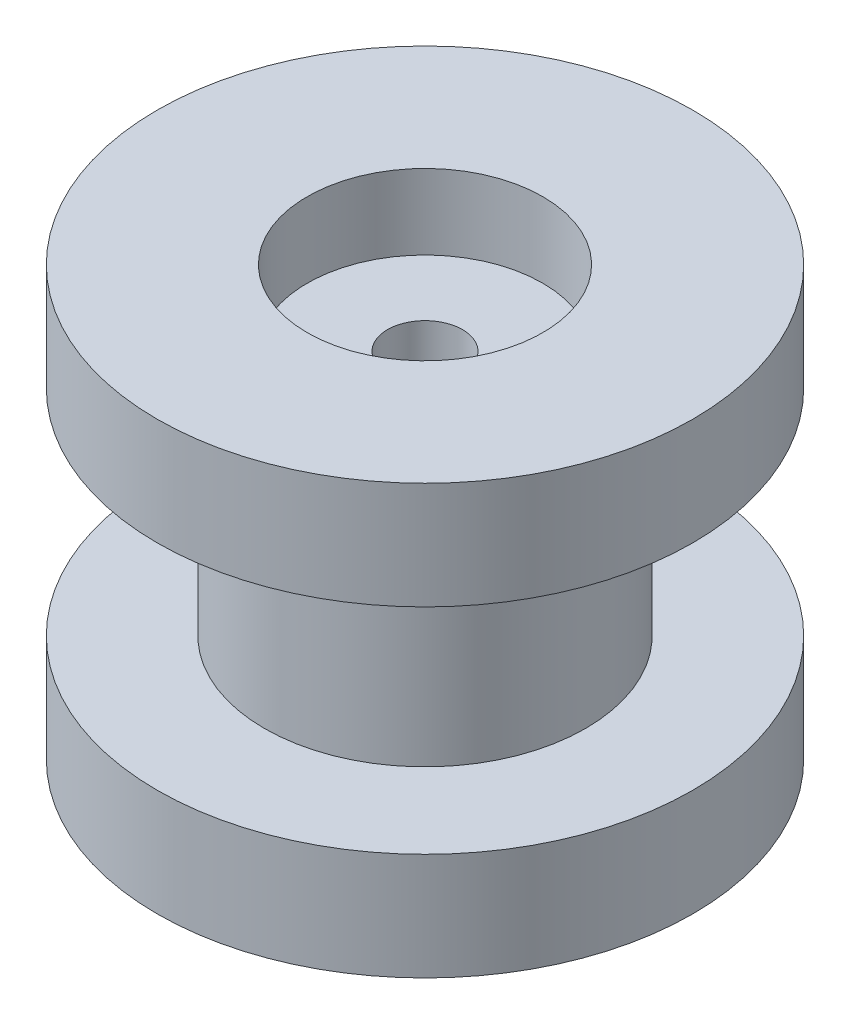
ISO-10303-21;
HEADER;
FILE_DESCRIPTION(('STEP AP214'),'2;1');
FILE_NAME('part.step','',(''),(''),'','','');
FILE_SCHEMA(('AUTOMOTIVE_DESIGN { 1 0 10303 214 1 1 1 1 }'));
ENDSEC;
DATA;
#1=APPLICATION_CONTEXT('core data for automotive mechanical design processes');
#2=APPLICATION_PROTOCOL_DEFINITION('international standard','automotive_design',2000,#1);
#3=PRODUCT_CONTEXT('',#1,'mechanical');
#4=PRODUCT('Part','Part','',(#3));
#5=PRODUCT_RELATED_PRODUCT_CATEGORY('part','',(#4));
#6=PRODUCT_DEFINITION_FORMATION('','',#4);
#7=PRODUCT_DEFINITION_CONTEXT('part definition',#1,'design');
#8=PRODUCT_DEFINITION('design','',#6,#7);
#9=PRODUCT_DEFINITION_SHAPE('','',#8);
#10=(LENGTH_UNIT() NAMED_UNIT(*) SI_UNIT(.MILLI.,.METRE.));
#11=(NAMED_UNIT(*) PLANE_ANGLE_UNIT() SI_UNIT($,.RADIAN.));
#12=(NAMED_UNIT(*) SI_UNIT($,.STERADIAN.) SOLID_ANGLE_UNIT());
#13=UNCERTAINTY_MEASURE_WITH_UNIT(LENGTH_MEASURE(1.E-05),#10,'distance_accuracy_value','');
#14=(GEOMETRIC_REPRESENTATION_CONTEXT(3) GLOBAL_UNCERTAINTY_ASSIGNED_CONTEXT((#13)) GLOBAL_UNIT_ASSIGNED_CONTEXT((#10,
#11,#12)) REPRESENTATION_CONTEXT('',''));
#15=CARTESIAN_POINT('',(0.,0.,0.));
#16=DIRECTION('',(0.,0.,1.));
#17=DIRECTION('',(1.,0.,0.));
#18=AXIS2_PLACEMENT_3D('',#15,#16,#17);
#19=CARTESIAN_POINT('',(0.,5.,0.));
#20=DIRECTION('',(0.,-1.,0.));
#21=DIRECTION('',(0.,0.,-1.));
#22=AXIS2_PLACEMENT_3D('',#19,#20,#21);
#23=CYLINDRICAL_SURFACE('',#22,12.5);
#24=CARTESIAN_POINT('',(0.,5.,0.));
#25=DIRECTION('',(0.,1.,0.));
#26=DIRECTION('',(0.,0.,1.));
#27=AXIS2_PLACEMENT_3D('',#24,#25,#26);
#28=CIRCLE('',#27,12.5);
#29=CARTESIAN_POINT('',(0.,5.,12.5));
#30=VERTEX_POINT('',#29);
#31=EDGE_CURVE('E41',#30,#30,#28,.T.);
#32=ORIENTED_EDGE('',*,*,#31,.F.);
#33=EDGE_LOOP('',(#32));
#34=FACE_BOUND('',#33,.T.);
#35=CARTESIAN_POINT('',(0.,0.,0.));
#36=DIRECTION('',(0.,1.,0.));
#37=DIRECTION('',(0.,0.,1.));
#38=AXIS2_PLACEMENT_3D('',#35,#36,#37);
#39=CIRCLE('',#38,12.5);
#40=CARTESIAN_POINT('',(0.,0.,12.5));
#41=VERTEX_POINT('',#40);
#42=EDGE_CURVE('E46',#41,#41,#39,.T.);
#43=ORIENTED_EDGE('',*,*,#42,.T.);
#44=EDGE_LOOP('',(#43));
#45=FACE_BOUND('',#44,.T.);
#46=ADVANCED_FACE('F34',(#34,#45),#23,.T.);
#47=CARTESIAN_POINT('',(0.,5.,0.));
#48=DIRECTION('',(0.,1.,0.));
#49=DIRECTION('',(0.,0.,1.));
#50=AXIS2_PLACEMENT_3D('',#47,#48,#49);
#51=PLANE('',#50);
#52=CARTESIAN_POINT('',(0.,5.,0.));
#53=DIRECTION('',(0.,1.,0.));
#54=DIRECTION('',(0.,0.,1.));
#55=AXIS2_PLACEMENT_3D('',#52,#53,#54);
#56=CIRCLE('',#55,7.5);
#57=CARTESIAN_POINT('',(0.,5.,7.5));
#58=VERTEX_POINT('',#57);
#59=EDGE_CURVE('E10',#58,#58,#56,.T.);
#60=ORIENTED_EDGE('',*,*,#59,.F.);
#61=EDGE_LOOP('',(#60));
#62=FACE_BOUND('',#61,.T.);
#63=ORIENTED_EDGE('',*,*,#31,.T.);
#64=EDGE_LOOP('',(#63));
#65=FACE_BOUND('',#64,.T.);
#66=ADVANCED_FACE('F110',(#62,#65),#51,.T.);
#67=CARTESIAN_POINT('',(0.,0.,0.));
#68=DIRECTION('',(0.,1.,0.));
#69=DIRECTION('',(0.,0.,1.));
#70=AXIS2_PLACEMENT_3D('',#67,#68,#69);
#71=PLANE('',#70);
#72=CARTESIAN_POINT('',(0.,0.,0.));
#73=DIRECTION('',(0.,-1.,0.));
#74=DIRECTION('',(0.,0.,-1.));
#75=AXIS2_PLACEMENT_3D('',#72,#73,#74);
#76=CIRCLE('',#75,1.75);
#77=CARTESIAN_POINT('',(0.,0.,-1.75));
#78=VERTEX_POINT('',#77);
#79=EDGE_CURVE('E68',#78,#78,#76,.T.);
#80=ORIENTED_EDGE('',*,*,#79,.F.);
#81=EDGE_LOOP('',(#80));
#82=FACE_BOUND('',#81,.T.);
#83=ORIENTED_EDGE('',*,*,#42,.F.);
#84=EDGE_LOOP('',(#83));
#85=FACE_BOUND('',#84,.T.);
#86=ADVANCED_FACE('F107',(#82,#85),#71,.F.);
#87=CARTESIAN_POINT('',(0.,10.,0.));
#88=DIRECTION('',(0.,-1.,0.));
#89=DIRECTION('',(0.,0.,-1.));
#90=AXIS2_PLACEMENT_3D('',#87,#88,#89);
#91=CYLINDRICAL_SURFACE('',#90,7.5);
#92=ORIENTED_EDGE('',*,*,#59,.T.);
#93=EDGE_LOOP('',(#92));
#94=FACE_BOUND('',#93,.T.);
#95=CARTESIAN_POINT('',(0.,15.,0.));
#96=DIRECTION('',(0.,1.,0.));
#97=DIRECTION('',(0.,0.,1.));
#98=AXIS2_PLACEMENT_3D('',#95,#96,#97);
#99=CIRCLE('',#98,7.5);
#100=CARTESIAN_POINT('',(0.,15.,7.5));
#101=VERTEX_POINT('',#100);
#102=EDGE_CURVE('E52',#101,#101,#99,.T.);
#103=ORIENTED_EDGE('',*,*,#102,.F.);
#104=EDGE_LOOP('',(#103));
#105=FACE_BOUND('',#104,.T.);
#106=ADVANCED_FACE('F99',(#94,#105),#91,.T.);
#107=CARTESIAN_POINT('',(0.,15.,0.));
#108=DIRECTION('',(0.,1.,0.));
#109=DIRECTION('',(0.,0.,-1.));
#110=AXIS2_PLACEMENT_3D('',#107,#108,#109);
#111=CYLINDRICAL_SURFACE('',#110,12.5);
#112=CARTESIAN_POINT('',(0.,15.,0.));
#113=DIRECTION('',(0.,1.,0.));
#114=DIRECTION('',(0.,0.,1.));
#115=AXIS2_PLACEMENT_3D('',#112,#113,#114);
#116=CIRCLE('',#115,12.5);
#117=CARTESIAN_POINT('',(0.,15.,12.5));
#118=VERTEX_POINT('',#117);
#119=EDGE_CURVE('E56',#118,#118,#116,.T.);
#120=ORIENTED_EDGE('',*,*,#119,.T.);
#121=EDGE_LOOP('',(#120));
#122=FACE_BOUND('',#121,.T.);
#123=CARTESIAN_POINT('',(0.,20.,0.));
#124=DIRECTION('',(0.,1.,0.));
#125=DIRECTION('',(0.,0.,1.));
#126=AXIS2_PLACEMENT_3D('',#123,#124,#125);
#127=CIRCLE('',#126,12.5);
#128=CARTESIAN_POINT('',(0.,20.,12.5));
#129=VERTEX_POINT('',#128);
#130=EDGE_CURVE('E49',#129,#129,#127,.T.);
#131=ORIENTED_EDGE('',*,*,#130,.F.);
#132=EDGE_LOOP('',(#131));
#133=FACE_BOUND('',#132,.T.);
#134=ADVANCED_FACE('F97',(#122,#133),#111,.T.);
#135=CARTESIAN_POINT('',(0.,15.,0.));
#136=DIRECTION('',(0.,-1.,0.));
#137=DIRECTION('',(0.,0.,1.));
#138=AXIS2_PLACEMENT_3D('',#135,#136,#137);
#139=PLANE('',#138);
#140=ORIENTED_EDGE('',*,*,#102,.T.);
#141=EDGE_LOOP('',(#140));
#142=FACE_BOUND('',#141,.T.);
#143=ORIENTED_EDGE('',*,*,#119,.F.);
#144=EDGE_LOOP('',(#143));
#145=FACE_BOUND('',#144,.T.);
#146=ADVANCED_FACE('F92',(#142,#145),#139,.T.);
#147=CARTESIAN_POINT('',(0.,20.,0.));
#148=DIRECTION('',(0.,-1.,0.));
#149=DIRECTION('',(0.,0.,1.));
#150=AXIS2_PLACEMENT_3D('',#147,#148,#149);
#151=PLANE('',#150);
#152=CARTESIAN_POINT('',(0.,20.,0.));
#153=DIRECTION('',(0.,1.,0.));
#154=DIRECTION('',(0.,0.,1.));
#155=AXIS2_PLACEMENT_3D('',#152,#153,#154);
#156=CIRCLE('',#155,5.5);
#157=CARTESIAN_POINT('',(0.,20.,5.5));
#158=VERTEX_POINT('',#157);
#159=EDGE_CURVE('E62',#158,#158,#156,.T.);
#160=ORIENTED_EDGE('',*,*,#159,.F.);
#161=EDGE_LOOP('',(#160));
#162=FACE_BOUND('',#161,.T.);
#163=ORIENTED_EDGE('',*,*,#130,.T.);
#164=EDGE_LOOP('',(#163));
#165=FACE_BOUND('',#164,.T.);
#166=ADVANCED_FACE('F86',(#162,#165),#151,.F.);
#167=CARTESIAN_POINT('',(0.,16.5,0.));
#168=DIRECTION('',(0.,1.,0.));
#169=DIRECTION('',(0.,0.,1.));
#170=AXIS2_PLACEMENT_3D('',#167,#168,#169);
#171=CYLINDRICAL_SURFACE('',#170,5.5);
#172=CARTESIAN_POINT('',(0.,16.5,0.));
#173=DIRECTION('',(0.,1.,0.));
#174=DIRECTION('',(0.,0.,1.));
#175=AXIS2_PLACEMENT_3D('',#172,#173,#174);
#176=CIRCLE('',#175,5.5);
#177=CARTESIAN_POINT('',(0.,16.5,5.5));
#178=VERTEX_POINT('',#177);
#179=EDGE_CURVE('E65',#178,#178,#176,.T.);
#180=ORIENTED_EDGE('',*,*,#179,.F.);
#181=EDGE_LOOP('',(#180));
#182=FACE_BOUND('',#181,.T.);
#183=ORIENTED_EDGE('',*,*,#159,.T.);
#184=EDGE_LOOP('',(#183));
#185=FACE_BOUND('',#184,.T.);
#186=ADVANCED_FACE('F80',(#182,#185),#171,.F.);
#187=CARTESIAN_POINT('',(0.,16.5,0.));
#188=DIRECTION('',(0.,1.,0.));
#189=DIRECTION('',(0.,0.,1.));
#190=AXIS2_PLACEMENT_3D('',#187,#188,#189);
#191=PLANE('',#190);
#192=CARTESIAN_POINT('',(0.,16.5,0.));
#193=DIRECTION('',(0.,1.,0.));
#194=DIRECTION('',(0.,0.,1.));
#195=AXIS2_PLACEMENT_3D('',#192,#193,#194);
#196=CIRCLE('',#195,1.75);
#197=CARTESIAN_POINT('',(0.,16.5,1.75));
#198=VERTEX_POINT('',#197);
#199=EDGE_CURVE('E37',#198,#198,#196,.T.);
#200=ORIENTED_EDGE('',*,*,#199,.F.);
#201=EDGE_LOOP('',(#200));
#202=FACE_BOUND('',#201,.T.);
#203=ORIENTED_EDGE('',*,*,#179,.T.);
#204=EDGE_LOOP('',(#203));
#205=FACE_BOUND('',#204,.T.);
#206=ADVANCED_FACE('F77',(#202,#205),#191,.T.);
#207=CARTESIAN_POINT('',(0.,20.,0.));
#208=DIRECTION('',(0.,-1.,0.));
#209=DIRECTION('',(0.,0.,-1.));
#210=AXIS2_PLACEMENT_3D('',#207,#208,#209);
#211=CYLINDRICAL_SURFACE('',#210,1.75);
#212=ORIENTED_EDGE('',*,*,#199,.T.);
#213=EDGE_LOOP('',(#212));
#214=FACE_BOUND('',#213,.T.);
#215=ORIENTED_EDGE('',*,*,#79,.T.);
#216=EDGE_LOOP('',(#215));
#217=FACE_BOUND('',#216,.T.);
#218=ADVANCED_FACE('F75',(#214,#217),#211,.F.);
#219=CLOSED_SHELL('',(#46,#66,#86,#106,#134,#146,#166,#186,#206,#218));
#220=MANIFOLD_SOLID_BREP('B2',#219);
#221=ADVANCED_BREP_SHAPE_REPRESENTATION('',(#18,#220),#14);
#222=SHAPE_DEFINITION_REPRESENTATION(#9,#221);
ENDSEC;
END-ISO-10303-21;
